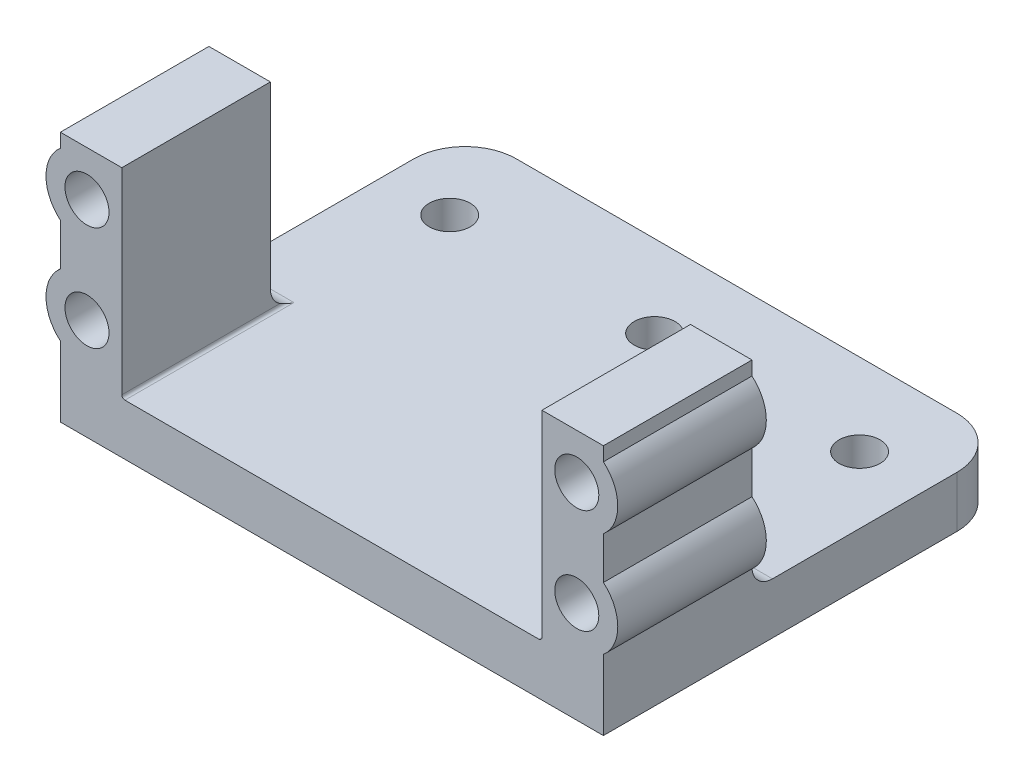
ISO-10303-21;
HEADER;
FILE_DESCRIPTION(('STEP AP214'),'2;1');
FILE_NAME('part.step','',(''),(''),'','','');
FILE_SCHEMA(('AUTOMOTIVE_DESIGN { 1 0 10303 214 1 1 1 1 }'));
ENDSEC;
DATA;
#1=APPLICATION_CONTEXT('core data for automotive mechanical design processes');
#2=APPLICATION_PROTOCOL_DEFINITION('international standard','automotive_design',2000,#1);
#3=PRODUCT_CONTEXT('',#1,'mechanical');
#4=PRODUCT('Part','Part','',(#3));
#5=PRODUCT_RELATED_PRODUCT_CATEGORY('part','',(#4));
#6=PRODUCT_DEFINITION_FORMATION('','',#4);
#7=PRODUCT_DEFINITION_CONTEXT('part definition',#1,'design');
#8=PRODUCT_DEFINITION('design','',#6,#7);
#9=PRODUCT_DEFINITION_SHAPE('','',#8);
#10=(LENGTH_UNIT() NAMED_UNIT(*) SI_UNIT(.MILLI.,.METRE.));
#11=(NAMED_UNIT(*) PLANE_ANGLE_UNIT() SI_UNIT($,.RADIAN.));
#12=(NAMED_UNIT(*) SI_UNIT($,.STERADIAN.) SOLID_ANGLE_UNIT());
#13=UNCERTAINTY_MEASURE_WITH_UNIT(LENGTH_MEASURE(1.E-05),#10,'distance_accuracy_value','');
#14=(GEOMETRIC_REPRESENTATION_CONTEXT(3) GLOBAL_UNCERTAINTY_ASSIGNED_CONTEXT((#13)) GLOBAL_UNIT_ASSIGNED_CONTEXT((#10,
#11,#12)) REPRESENTATION_CONTEXT('',''));
#15=CARTESIAN_POINT('',(0.,0.,0.));
#16=DIRECTION('',(0.,0.,1.));
#17=DIRECTION('',(1.,0.,0.));
#18=AXIS2_PLACEMENT_3D('',#15,#16,#17);
#19=CARTESIAN_POINT('',(-26.5,-2.5,26.5));
#20=DIRECTION('',(1.,0.,0.));
#21=DIRECTION('',(0.,0.,-1.));
#22=AXIS2_PLACEMENT_3D('',#19,#20,#21);
#23=PLANE('',#22);
#24=DIRECTION('',(0.,0.,1.));
#25=VECTOR('',#24,1.);
#26=CARTESIAN_POINT('',(-26.5,10.439736830714,1.10229381933987));
#27=LINE('',#26,#25);
#28=CARTESIAN_POINT('',(-26.5,10.439736830714,26.5));
#29=VERTEX_POINT('',#28);
#30=CARTESIAN_POINT('',(-26.5,10.439736830714,12.));
#31=VERTEX_POINT('',#30);
#32=EDGE_CURVE('E355',#29,#31,#27,.F.);
#33=ORIENTED_EDGE('',*,*,#32,.F.);
#34=DIRECTION('',(0.,-1.,0.));
#35=VECTOR('',#34,1.);
#36=CARTESIAN_POINT('',(-26.5,-2.5,26.5));
#37=LINE('',#36,#35);
#38=CARTESIAN_POINT('',(-26.5,14.5602631692859,26.5));
#39=VERTEX_POINT('',#38);
#40=EDGE_CURVE('E358',#39,#29,#37,.T.);
#41=ORIENTED_EDGE('',*,*,#40,.F.);
#42=DIRECTION('',(0.,0.,1.));
#43=VECTOR('',#42,1.);
#44=CARTESIAN_POINT('',(-26.5,14.5602631692859,1.10229381933987));
#45=LINE('',#44,#43);
#46=CARTESIAN_POINT('',(-26.5,14.5602631692859,12.0000000000001));
#47=VERTEX_POINT('',#46);
#48=EDGE_CURVE('E558',#47,#39,#45,.T.);
#49=ORIENTED_EDGE('',*,*,#48,.F.);
#50=DIRECTION('',(0.,1.,0.));
#51=VECTOR('',#50,1.);
#52=CARTESIAN_POINT('',(-26.5,-10.9164078649988,12.));
#53=LINE('',#52,#51);
#54=EDGE_CURVE('E359',#31,#47,#53,.T.);
#55=ORIENTED_EDGE('',*,*,#54,.F.);
#56=EDGE_LOOP('',(#33,#41,#49,#55));
#57=FACE_BOUND('',#56,.T.);
#58=ADVANCED_FACE('F32',(#57),#23,.F.);
#59=DIRECTION('',(0.,0.,-1.));
#60=VECTOR('',#59,1.);
#61=CARTESIAN_POINT('',(-26.5,-2.5,26.5));
#62=LINE('',#61,#60);
#63=CARTESIAN_POINT('',(-26.5,-2.5,26.5));
#64=VERTEX_POINT('',#63);
#65=CARTESIAN_POINT('',(-26.5,-2.5,-8.));
#66=VERTEX_POINT('',#65);
#67=EDGE_CURVE('E54',#64,#66,#62,.T.);
#68=ORIENTED_EDGE('',*,*,#67,.F.);
#69=CARTESIAN_POINT('',(-26.5,4.36026316928588,26.5));
#70=VERTEX_POINT('',#69);
#71=EDGE_CURVE('E371',#70,#64,#37,.T.);
#72=ORIENTED_EDGE('',*,*,#71,.F.);
#73=DIRECTION('',(0.,0.,1.));
#74=VECTOR('',#73,1.);
#75=CARTESIAN_POINT('',(-26.5,4.36026316928591,1.10229381933987));
#76=LINE('',#75,#74);
#77=CARTESIAN_POINT('',(-26.5,4.36026316928591,11.9951124324564));
#78=VERTEX_POINT('',#77);
#79=EDGE_CURVE('E363',#78,#70,#76,.T.);
#80=ORIENTED_EDGE('',*,*,#79,.F.);
#81=CARTESIAN_POINT('',(-26.5,4.5,10.));
#82=DIRECTION('',(1.,0.,0.));
#83=DIRECTION('',(0.,0.,-1.));
#84=AXIS2_PLACEMENT_3D('',#81,#82,#83);
#85=CIRCLE('',#84,2.);
#86=CARTESIAN_POINT('',(-26.5,2.5,10.));
#87=VERTEX_POINT('',#86);
#88=EDGE_CURVE('E435',#78,#87,#85,.T.);
#89=ORIENTED_EDGE('',*,*,#88,.T.);
#90=DIRECTION('',(0.,0.,1.));
#91=VECTOR('',#90,1.);
#92=CARTESIAN_POINT('',(-26.5,2.5,12.));
#93=LINE('',#92,#91);
#94=CARTESIAN_POINT('',(-26.5,2.5,-8.));
#95=VERTEX_POINT('',#94);
#96=EDGE_CURVE('E407',#95,#87,#93,.T.);
#97=ORIENTED_EDGE('',*,*,#96,.F.);
#98=DIRECTION('',(0.,1.,0.));
#99=VECTOR('',#98,1.);
#100=CARTESIAN_POINT('',(-26.5,-2.5,-8.));
#101=LINE('',#100,#99);
#102=EDGE_CURVE('E533',#95,#66,#101,.F.);
#103=ORIENTED_EDGE('',*,*,#102,.T.);
#104=EDGE_LOOP('',(#68,#72,#80,#89,#97,#103));
#105=FACE_BOUND('',#104,.T.);
#106=ADVANCED_FACE('F337',(#105),#23,.F.);
#107=DIRECTION('',(0.,0.,1.));
#108=VECTOR('',#107,1.);
#109=CARTESIAN_POINT('',(-26.5,20.639736830714,1.10229381933987));
#110=LINE('',#109,#108);
#111=CARTESIAN_POINT('',(-26.5,20.639736830714,26.5));
#112=VERTEX_POINT('',#111);
#113=CARTESIAN_POINT('',(-26.5,20.639736830714,12.));
#114=VERTEX_POINT('',#113);
#115=EDGE_CURVE('E476',#112,#114,#110,.F.);
#116=ORIENTED_EDGE('',*,*,#115,.F.);
#117=CARTESIAN_POINT('',(-26.5,22.,26.5));
#118=VERTEX_POINT('',#117);
#119=EDGE_CURVE('E370',#118,#112,#37,.T.);
#120=ORIENTED_EDGE('',*,*,#119,.F.);
#121=DIRECTION('',(0.,0.,-1.));
#122=VECTOR('',#121,1.);
#123=CARTESIAN_POINT('',(-26.5,22.,26.5));
#124=LINE('',#123,#122);
#125=CARTESIAN_POINT('',(-26.5,22.,12.));
#126=VERTEX_POINT('',#125);
#127=EDGE_CURVE('E224',#118,#126,#124,.T.);
#128=ORIENTED_EDGE('',*,*,#127,.T.);
#129=EDGE_CURVE('E396',#114,#126,#53,.T.);
#130=ORIENTED_EDGE('',*,*,#129,.F.);
#131=EDGE_LOOP('',(#116,#120,#128,#130));
#132=FACE_BOUND('',#131,.T.);
#133=ADVANCED_FACE('F335',(#132),#23,.F.);
#134=CARTESIAN_POINT('',(26.5,-2.5,26.5));
#135=DIRECTION('',(-1.,0.,0.));
#136=DIRECTION('',(0.,0.,1.));
#137=AXIS2_PLACEMENT_3D('',#134,#135,#136);
#138=PLANE('',#137);
#139=DIRECTION('',(0.,1.,0.));
#140=VECTOR('',#139,1.);
#141=CARTESIAN_POINT('',(26.5,-2.5,26.5));
#142=LINE('',#141,#140);
#143=CARTESIAN_POINT('',(26.5,-2.5,26.5));
#144=VERTEX_POINT('',#143);
#145=CARTESIAN_POINT('',(26.5,4.36026316928588,26.5));
#146=VERTEX_POINT('',#145);
#147=EDGE_CURVE('E378',#144,#146,#142,.T.);
#148=ORIENTED_EDGE('',*,*,#147,.F.);
#149=DIRECTION('',(0.,0.,-1.));
#150=VECTOR('',#149,1.);
#151=CARTESIAN_POINT('',(26.5,-2.5,26.5));
#152=LINE('',#151,#150);
#153=CARTESIAN_POINT('',(26.5,-2.5,-8.));
#154=VERTEX_POINT('',#153);
#155=EDGE_CURVE('E46',#144,#154,#152,.T.);
#156=ORIENTED_EDGE('',*,*,#155,.T.);
#157=DIRECTION('',(0.,-1.,0.));
#158=VECTOR('',#157,1.);
#159=CARTESIAN_POINT('',(26.5,2.5,-8.));
#160=LINE('',#159,#158);
#161=CARTESIAN_POINT('',(26.5,2.5,-8.));
#162=VERTEX_POINT('',#161);
#163=EDGE_CURVE('E11',#154,#162,#160,.F.);
#164=ORIENTED_EDGE('',*,*,#163,.T.);
#165=DIRECTION('',(0.,0.,-1.));
#166=VECTOR('',#165,1.);
#167=CARTESIAN_POINT('',(26.5,2.5,12.));
#168=LINE('',#167,#166);
#169=CARTESIAN_POINT('',(26.5,2.5,9.99999999999999));
#170=VERTEX_POINT('',#169);
#171=EDGE_CURVE('E421',#170,#162,#168,.T.);
#172=ORIENTED_EDGE('',*,*,#171,.F.);
#173=CARTESIAN_POINT('',(26.5,4.5,9.99999999999999));
#174=DIRECTION('',(-1.,0.,0.));
#175=DIRECTION('',(0.,0.,1.));
#176=AXIS2_PLACEMENT_3D('',#173,#174,#175);
#177=CIRCLE('',#176,2.);
#178=CARTESIAN_POINT('',(26.5,4.36026316928591,11.9951124324564));
#179=VERTEX_POINT('',#178);
#180=EDGE_CURVE('E291',#170,#179,#177,.T.);
#181=ORIENTED_EDGE('',*,*,#180,.T.);
#182=DIRECTION('',(0.,0.,1.));
#183=VECTOR('',#182,1.);
#184=CARTESIAN_POINT('',(26.5,4.36026316928591,1.10229381933982));
#185=LINE('',#184,#183);
#186=EDGE_CURVE('E489',#179,#146,#185,.T.);
#187=ORIENTED_EDGE('',*,*,#186,.T.);
#188=EDGE_LOOP('',(#148,#156,#164,#172,#181,#187));
#189=FACE_BOUND('',#188,.T.);
#190=ADVANCED_FACE('F329',(#189),#138,.F.);
#191=CARTESIAN_POINT('',(26.5,10.439736830714,26.5));
#192=VERTEX_POINT('',#191);
#193=CARTESIAN_POINT('',(26.5,14.5602631692859,26.5));
#194=VERTEX_POINT('',#193);
#195=EDGE_CURVE('E381',#192,#194,#142,.T.);
#196=ORIENTED_EDGE('',*,*,#195,.F.);
#197=DIRECTION('',(0.,0.,1.));
#198=VECTOR('',#197,1.);
#199=CARTESIAN_POINT('',(26.5,10.439736830714,1.10229381933982));
#200=LINE('',#199,#198);
#201=CARTESIAN_POINT('',(26.5,10.439736830714,12.));
#202=VERTEX_POINT('',#201);
#203=EDGE_CURVE('E484',#192,#202,#200,.F.);
#204=ORIENTED_EDGE('',*,*,#203,.T.);
#205=DIRECTION('',(0.,1.,0.));
#206=VECTOR('',#205,1.);
#207=CARTESIAN_POINT('',(26.5,-10.9164078649987,12.));
#208=LINE('',#207,#206);
#209=CARTESIAN_POINT('',(26.5,14.5602631692859,12.));
#210=VERTEX_POINT('',#209);
#211=EDGE_CURVE('E405',#202,#210,#208,.T.);
#212=ORIENTED_EDGE('',*,*,#211,.T.);
#213=DIRECTION('',(0.,0.,1.));
#214=VECTOR('',#213,1.);
#215=CARTESIAN_POINT('',(26.5,14.5602631692859,1.10229381933982));
#216=LINE('',#215,#214);
#217=EDGE_CURVE('E413',#210,#194,#216,.T.);
#218=ORIENTED_EDGE('',*,*,#217,.T.);
#219=EDGE_LOOP('',(#196,#204,#212,#218));
#220=FACE_BOUND('',#219,.T.);
#221=ADVANCED_FACE('F330',(#220),#138,.F.);
#222=CARTESIAN_POINT('',(-20.5,22.,26.5));
#223=DIRECTION('',(-1.,0.,0.));
#224=DIRECTION('',(0.,-1.,0.));
#225=AXIS2_PLACEMENT_3D('',#222,#223,#224);
#226=PLANE('',#225);
#227=DIRECTION('',(0.,0.,-1.));
#228=VECTOR('',#227,1.);
#229=CARTESIAN_POINT('',(-20.5,22.,26.5));
#230=LINE('',#229,#228);
#231=CARTESIAN_POINT('',(-20.5,22.,26.5));
#232=VERTEX_POINT('',#231);
#233=CARTESIAN_POINT('',(-20.5,22.,12.));
#234=VERTEX_POINT('',#233);
#235=EDGE_CURVE('E220',#232,#234,#230,.T.);
#236=ORIENTED_EDGE('',*,*,#235,.F.);
#237=DIRECTION('',(0.,1.,0.));
#238=VECTOR('',#237,1.);
#239=CARTESIAN_POINT('',(-20.5,22.,26.5));
#240=LINE('',#239,#238);
#241=CARTESIAN_POINT('',(-20.5,2.8,26.5));
#242=VERTEX_POINT('',#241);
#243=EDGE_CURVE('E417',#242,#232,#240,.T.);
#244=ORIENTED_EDGE('',*,*,#243,.F.);
#245=DIRECTION('',(0.,0.,-1.));
#246=VECTOR('',#245,1.);
#247=CARTESIAN_POINT('',(-20.5,2.8,12.));
#248=LINE('',#247,#246);
#249=CARTESIAN_POINT('',(-20.5,2.8,11.0535653752871));
#250=VERTEX_POINT('',#249);
#251=EDGE_CURVE('E213',#242,#250,#248,.T.);
#252=ORIENTED_EDGE('',*,*,#251,.T.);
#253=CARTESIAN_POINT('',(-20.5,4.5,10.));
#254=DIRECTION('',(-1.,0.,0.));
#255=DIRECTION('',(0.,-1.,0.));
#256=AXIS2_PLACEMENT_3D('',#253,#254,#255);
#257=CIRCLE('',#256,2.);
#258=CARTESIAN_POINT('',(-20.5,4.5,12.));
#259=VERTEX_POINT('',#258);
#260=EDGE_CURVE('E249',#250,#259,#257,.T.);
#261=ORIENTED_EDGE('',*,*,#260,.T.);
#262=DIRECTION('',(0.,1.,0.));
#263=VECTOR('',#262,1.);
#264=CARTESIAN_POINT('',(-20.5,-10.9164078649988,12.));
#265=LINE('',#264,#263);
#266=EDGE_CURVE('E404',#259,#234,#265,.T.);
#267=ORIENTED_EDGE('',*,*,#266,.T.);
#268=EDGE_LOOP('',(#236,#244,#252,#261,#267));
#269=FACE_BOUND('',#268,.T.);
#270=ADVANCED_FACE('F264',(#269),#226,.F.);
#271=CARTESIAN_POINT('',(-26.5,22.,26.5));
#272=DIRECTION('',(0.,-1.,0.));
#273=DIRECTION('',(1.,0.,0.));
#274=AXIS2_PLACEMENT_3D('',#271,#272,#273);
#275=PLANE('',#274);
#276=ORIENTED_EDGE('',*,*,#235,.T.);
#277=DIRECTION('',(1.,0.,0.));
#278=VECTOR('',#277,1.);
#279=CARTESIAN_POINT('',(-26.5,22.,12.));
#280=LINE('',#279,#278);
#281=EDGE_CURVE('E401',#126,#234,#280,.T.);
#282=ORIENTED_EDGE('',*,*,#281,.F.);
#283=ORIENTED_EDGE('',*,*,#127,.F.);
#284=DIRECTION('',(-1.,0.,0.));
#285=VECTOR('',#284,1.);
#286=CARTESIAN_POINT('',(-26.5,22.,26.5));
#287=LINE('',#286,#285);
#288=EDGE_CURVE('E374',#232,#118,#287,.T.);
#289=ORIENTED_EDGE('',*,*,#288,.F.);
#290=EDGE_LOOP('',(#276,#282,#283,#289));
#291=FACE_BOUND('',#290,.T.);
#292=ADVANCED_FACE('F333',(#291),#275,.F.);
#293=CARTESIAN_POINT('',(-26.5,-2.5,26.5));
#294=DIRECTION('',(0.,1.,0.));
#295=DIRECTION('',(0.,0.,1.));
#296=AXIS2_PLACEMENT_3D('',#293,#294,#295);
#297=PLANE('',#296);
#298=CARTESIAN_POINT('',(20.,-2.5,-5.));
#299=DIRECTION('',(0.,1.,0.));
#300=DIRECTION('',(0.,0.,1.));
#301=AXIS2_PLACEMENT_3D('',#298,#299,#300);
#302=CIRCLE('',#301,2.);
#303=CARTESIAN_POINT('',(20.,-2.5,-3.));
#304=VERTEX_POINT('',#303);
#305=EDGE_CURVE('E547',#304,#304,#302,.T.);
#306=ORIENTED_EDGE('',*,*,#305,.T.);
#307=EDGE_LOOP('',(#306));
#308=FACE_BOUND('',#307,.T.);
#309=CARTESIAN_POINT('',(0.,-2.5,-5.));
#310=DIRECTION('',(0.,1.,0.));
#311=DIRECTION('',(0.,0.,1.));
#312=AXIS2_PLACEMENT_3D('',#309,#310,#311);
#313=CIRCLE('',#312,2.);
#314=CARTESIAN_POINT('',(0.,-2.5,-3.));
#315=VERTEX_POINT('',#314);
#316=EDGE_CURVE('E616',#315,#315,#313,.T.);
#317=ORIENTED_EDGE('',*,*,#316,.T.);
#318=EDGE_LOOP('',(#317));
#319=FACE_BOUND('',#318,.T.);
#320=CARTESIAN_POINT('',(-20.,-2.5,-5.));
#321=DIRECTION('',(0.,1.,0.));
#322=DIRECTION('',(0.,0.,1.));
#323=AXIS2_PLACEMENT_3D('',#320,#321,#322);
#324=CIRCLE('',#323,2.);
#325=CARTESIAN_POINT('',(-20.,-2.5,-3.));
#326=VERTEX_POINT('',#325);
#327=EDGE_CURVE('E619',#326,#326,#324,.T.);
#328=ORIENTED_EDGE('',*,*,#327,.T.);
#329=EDGE_LOOP('',(#328));
#330=FACE_BOUND('',#329,.T.);
#331=ORIENTED_EDGE('',*,*,#155,.F.);
#332=DIRECTION('',(-1.,0.,0.));
#333=VECTOR('',#332,1.);
#334=CARTESIAN_POINT('',(-29.267654900714,-2.5,26.5));
#335=LINE('',#334,#333);
#336=EDGE_CURVE('E203',#144,#64,#335,.T.);
#337=ORIENTED_EDGE('',*,*,#336,.T.);
#338=ORIENTED_EDGE('',*,*,#67,.T.);
#339=CARTESIAN_POINT('',(-21.5,-2.5,-8.));
#340=DIRECTION('',(0.,1.,0.));
#341=DIRECTION('',(0.,0.,1.));
#342=AXIS2_PLACEMENT_3D('',#339,#340,#341);
#343=CIRCLE('',#342,5.);
#344=CARTESIAN_POINT('',(-21.5,-2.5,-13.));
#345=VERTEX_POINT('',#344);
#346=EDGE_CURVE('E40',#66,#345,#343,.F.);
#347=ORIENTED_EDGE('',*,*,#346,.T.);
#348=DIRECTION('',(-1.,0.,0.));
#349=VECTOR('',#348,1.);
#350=CARTESIAN_POINT('',(26.5,-2.5,-13.));
#351=LINE('',#350,#349);
#352=CARTESIAN_POINT('',(21.5,-2.5,-13.));
#353=VERTEX_POINT('',#352);
#354=EDGE_CURVE('E541',#353,#345,#351,.T.);
#355=ORIENTED_EDGE('',*,*,#354,.F.);
#356=CARTESIAN_POINT('',(21.5,-2.5,-8.));
#357=DIRECTION('',(0.,1.,0.));
#358=DIRECTION('',(0.,0.,1.));
#359=AXIS2_PLACEMENT_3D('',#356,#357,#358);
#360=CIRCLE('',#359,5.);
#361=EDGE_CURVE('E525',#353,#154,#360,.F.);
#362=ORIENTED_EDGE('',*,*,#361,.T.);
#363=EDGE_LOOP('',(#331,#337,#338,#347,#355,#362));
#364=FACE_BOUND('',#363,.T.);
#365=ADVANCED_FACE('F327',(#308,#319,#330,#364),#297,.F.);
#366=CARTESIAN_POINT('',(26.5,20.639736830714,26.5));
#367=VERTEX_POINT('',#366);
#368=CARTESIAN_POINT('',(26.5,22.,26.5));
#369=VERTEX_POINT('',#368);
#370=EDGE_CURVE('E373',#367,#369,#142,.T.);
#371=ORIENTED_EDGE('',*,*,#370,.F.);
#372=DIRECTION('',(0.,0.,1.));
#373=VECTOR('',#372,1.);
#374=CARTESIAN_POINT('',(26.5,20.639736830714,1.10229381933982));
#375=LINE('',#374,#373);
#376=CARTESIAN_POINT('',(26.5,20.639736830714,12.));
#377=VERTEX_POINT('',#376);
#378=EDGE_CURVE('E496',#367,#377,#375,.F.);
#379=ORIENTED_EDGE('',*,*,#378,.T.);
#380=CARTESIAN_POINT('',(26.5,22.,12.));
#381=VERTEX_POINT('',#380);
#382=EDGE_CURVE('E409',#377,#381,#208,.T.);
#383=ORIENTED_EDGE('',*,*,#382,.T.);
#384=DIRECTION('',(0.,0.,-1.));
#385=VECTOR('',#384,1.);
#386=CARTESIAN_POINT('',(26.5,22.,26.5));
#387=LINE('',#386,#385);
#388=EDGE_CURVE('E387',#369,#381,#387,.T.);
#389=ORIENTED_EDGE('',*,*,#388,.F.);
#390=EDGE_LOOP('',(#371,#379,#383,#389));
#391=FACE_BOUND('',#390,.T.);
#392=ADVANCED_FACE('F323',(#391),#138,.F.);
#393=CARTESIAN_POINT('',(26.5,22.,26.5));
#394=DIRECTION('',(0.,-1.,0.));
#395=DIRECTION('',(0.,0.,-1.));
#396=AXIS2_PLACEMENT_3D('',#393,#394,#395);
#397=PLANE('',#396);
#398=ORIENTED_EDGE('',*,*,#388,.T.);
#399=DIRECTION('',(1.,0.,0.));
#400=VECTOR('',#399,1.);
#401=CARTESIAN_POINT('',(26.5,22.,12.));
#402=LINE('',#401,#400);
#403=CARTESIAN_POINT('',(20.5,22.,12.));
#404=VERTEX_POINT('',#403);
#405=EDGE_CURVE('E418',#404,#381,#402,.T.);
#406=ORIENTED_EDGE('',*,*,#405,.F.);
#407=DIRECTION('',(0.,0.,-1.));
#408=VECTOR('',#407,1.);
#409=CARTESIAN_POINT('',(20.5,22.,26.5));
#410=LINE('',#409,#408);
#411=CARTESIAN_POINT('',(20.5,22.,26.5));
#412=VERTEX_POINT('',#411);
#413=EDGE_CURVE('E384',#412,#404,#410,.T.);
#414=ORIENTED_EDGE('',*,*,#413,.F.);
#415=DIRECTION('',(-1.,0.,0.));
#416=VECTOR('',#415,1.);
#417=CARTESIAN_POINT('',(26.5,22.,26.5));
#418=LINE('',#417,#416);
#419=EDGE_CURVE('E380',#369,#412,#418,.T.);
#420=ORIENTED_EDGE('',*,*,#419,.F.);
#421=EDGE_LOOP('',(#398,#406,#414,#420));
#422=FACE_BOUND('',#421,.T.);
#423=ADVANCED_FACE('F319',(#422),#397,.F.);
#424=CARTESIAN_POINT('',(20.5,22.,26.5));
#425=DIRECTION('',(1.,0.,0.));
#426=DIRECTION('',(0.,1.,0.));
#427=AXIS2_PLACEMENT_3D('',#424,#425,#426);
#428=PLANE('',#427);
#429=DIRECTION('',(0.,0.,-1.));
#430=VECTOR('',#429,1.);
#431=CARTESIAN_POINT('',(20.5,2.8,26.5));
#432=LINE('',#431,#430);
#433=CARTESIAN_POINT('',(20.5,2.8,11.0535653752871));
#434=VERTEX_POINT('',#433);
#435=CARTESIAN_POINT('',(20.5,2.8,26.5));
#436=VERTEX_POINT('',#435);
#437=EDGE_CURVE('E214',#434,#436,#432,.F.);
#438=ORIENTED_EDGE('',*,*,#437,.T.);
#439=DIRECTION('',(0.,-1.,0.));
#440=VECTOR('',#439,1.);
#441=CARTESIAN_POINT('',(20.5,22.,26.5));
#442=LINE('',#441,#440);
#443=EDGE_CURVE('E210',#412,#436,#442,.T.);
#444=ORIENTED_EDGE('',*,*,#443,.F.);
#445=ORIENTED_EDGE('',*,*,#413,.T.);
#446=DIRECTION('',(0.,1.,0.));
#447=VECTOR('',#446,1.);
#448=CARTESIAN_POINT('',(20.5,-10.9164078649987,12.));
#449=LINE('',#448,#447);
#450=CARTESIAN_POINT('',(20.5,4.5,12.));
#451=VERTEX_POINT('',#450);
#452=EDGE_CURVE('E424',#451,#404,#449,.T.);
#453=ORIENTED_EDGE('',*,*,#452,.F.);
#454=CARTESIAN_POINT('',(20.5,4.5,10.));
#455=DIRECTION('',(1.,0.,0.));
#456=DIRECTION('',(0.,1.,0.));
#457=AXIS2_PLACEMENT_3D('',#454,#455,#456);
#458=CIRCLE('',#457,2.);
#459=EDGE_CURVE('E274',#451,#434,#458,.T.);
#460=ORIENTED_EDGE('',*,*,#459,.T.);
#461=EDGE_LOOP('',(#438,#444,#445,#453,#460));
#462=FACE_BOUND('',#461,.T.);
#463=ADVANCED_FACE('F315',(#462),#428,.F.);
#464=CARTESIAN_POINT('',(-20.5,2.5,26.5));
#465=DIRECTION('',(0.,-1.,0.));
#466=DIRECTION('',(0.,0.,-1.));
#467=AXIS2_PLACEMENT_3D('',#464,#465,#466);
#468=PLANE('',#467);
#469=CARTESIAN_POINT('',(20.,2.5,-5.));
#470=DIRECTION('',(0.,1.,0.));
#471=DIRECTION('',(0.,0.,1.));
#472=AXIS2_PLACEMENT_3D('',#469,#470,#471);
#473=CIRCLE('',#472,2.);
#474=CARTESIAN_POINT('',(20.,2.5,-3.));
#475=VERTEX_POINT('',#474);
#476=EDGE_CURVE('E613',#475,#475,#473,.T.);
#477=ORIENTED_EDGE('',*,*,#476,.F.);
#478=EDGE_LOOP('',(#477));
#479=FACE_BOUND('',#478,.T.);
#480=CARTESIAN_POINT('',(0.,2.5,-5.));
#481=DIRECTION('',(0.,1.,0.));
#482=DIRECTION('',(0.,0.,1.));
#483=AXIS2_PLACEMENT_3D('',#480,#481,#482);
#484=CIRCLE('',#483,2.);
#485=CARTESIAN_POINT('',(0.,2.5,-3.));
#486=VERTEX_POINT('',#485);
#487=EDGE_CURVE('E627',#486,#486,#484,.T.);
#488=ORIENTED_EDGE('',*,*,#487,.F.);
#489=EDGE_LOOP('',(#488));
#490=FACE_BOUND('',#489,.T.);
#491=CARTESIAN_POINT('',(-20.,2.5,-5.));
#492=DIRECTION('',(0.,1.,0.));
#493=DIRECTION('',(0.,0.,1.));
#494=AXIS2_PLACEMENT_3D('',#491,#492,#493);
#495=CIRCLE('',#494,2.);
#496=CARTESIAN_POINT('',(-20.,2.5,-3.));
#497=VERTEX_POINT('',#496);
#498=EDGE_CURVE('E624',#497,#497,#495,.T.);
#499=ORIENTED_EDGE('',*,*,#498,.F.);
#500=EDGE_LOOP('',(#499));
#501=FACE_BOUND('',#500,.T.);
#502=DIRECTION('',(0.,0.,-1.));
#503=VECTOR('',#502,1.);
#504=CARTESIAN_POINT('',(-20.2,2.5,26.5));
#505=LINE('',#504,#503);
#506=CARTESIAN_POINT('',(-20.2,2.5,10.));
#507=VERTEX_POINT('',#506);
#508=CARTESIAN_POINT('',(-20.2,2.5,26.5));
#509=VERTEX_POINT('',#508);
#510=EDGE_CURVE('E200',#507,#509,#505,.F.);
#511=ORIENTED_EDGE('',*,*,#510,.T.);
#512=DIRECTION('',(-1.,0.,0.));
#513=VECTOR('',#512,1.);
#514=CARTESIAN_POINT('',(-29.267654900714,2.5,26.5));
#515=LINE('',#514,#513);
#516=CARTESIAN_POINT('',(20.2,2.5,26.5));
#517=VERTEX_POINT('',#516);
#518=EDGE_CURVE('E192',#517,#509,#515,.T.);
#519=ORIENTED_EDGE('',*,*,#518,.F.);
#520=DIRECTION('',(0.,0.,-1.));
#521=VECTOR('',#520,1.);
#522=CARTESIAN_POINT('',(20.2,2.5,12.));
#523=LINE('',#522,#521);
#524=CARTESIAN_POINT('',(20.2,2.5,10.));
#525=VERTEX_POINT('',#524);
#526=EDGE_CURVE('E197',#517,#525,#523,.T.);
#527=ORIENTED_EDGE('',*,*,#526,.T.);
#528=DIRECTION('',(1.,0.,0.));
#529=VECTOR('',#528,1.);
#530=CARTESIAN_POINT('',(26.5,2.5,9.99999999999999));
#531=LINE('',#530,#529);
#532=EDGE_CURVE('E232',#525,#170,#531,.T.);
#533=ORIENTED_EDGE('',*,*,#532,.T.);
#534=ORIENTED_EDGE('',*,*,#171,.T.);
#535=CARTESIAN_POINT('',(21.5,2.5,-8.));
#536=DIRECTION('',(0.,-1.,0.));
#537=DIRECTION('',(0.,0.,-1.));
#538=AXIS2_PLACEMENT_3D('',#535,#536,#537);
#539=CIRCLE('',#538,5.);
#540=CARTESIAN_POINT('',(21.5,2.5,-13.));
#541=VERTEX_POINT('',#540);
#542=EDGE_CURVE('E527',#162,#541,#539,.F.);
#543=ORIENTED_EDGE('',*,*,#542,.T.);
#544=DIRECTION('',(1.,0.,0.));
#545=VECTOR('',#544,1.);
#546=CARTESIAN_POINT('',(-26.5,2.5,-13.));
#547=LINE('',#546,#545);
#548=CARTESIAN_POINT('',(-21.5,2.5,-13.));
#549=VERTEX_POINT('',#548);
#550=EDGE_CURVE('E546',#549,#541,#547,.T.);
#551=ORIENTED_EDGE('',*,*,#550,.F.);
#552=CARTESIAN_POINT('',(-21.5,2.5,-8.));
#553=DIRECTION('',(0.,-1.,0.));
#554=DIRECTION('',(0.,0.,-1.));
#555=AXIS2_PLACEMENT_3D('',#552,#553,#554);
#556=CIRCLE('',#555,5.);
#557=EDGE_CURVE('E530',#549,#95,#556,.F.);
#558=ORIENTED_EDGE('',*,*,#557,.T.);
#559=ORIENTED_EDGE('',*,*,#96,.T.);
#560=DIRECTION('',(1.,0.,0.));
#561=VECTOR('',#560,1.);
#562=CARTESIAN_POINT('',(-20.2,2.5,10.));
#563=LINE('',#562,#561);
#564=EDGE_CURVE('E234',#87,#507,#563,.T.);
#565=ORIENTED_EDGE('',*,*,#564,.T.);
#566=EDGE_LOOP('',(#511,#519,#527,#533,#534,#543,#551,#558,#559,#565));
#567=FACE_BOUND('',#566,.T.);
#568=ADVANCED_FACE('F194',(#479,#490,#501,#567),#468,.F.);
#569=CARTESIAN_POINT('',(0.,0.,26.5));
#570=DIRECTION('',(0.,0.,1.));
#571=DIRECTION('',(1.,0.,0.));
#572=AXIS2_PLACEMENT_3D('',#569,#570,#571);
#573=PLANE('',#572);
#574=ORIENTED_EDGE('',*,*,#71,.T.);
#575=ORIENTED_EDGE('',*,*,#336,.F.);
#576=ORIENTED_EDGE('',*,*,#147,.T.);
#577=CARTESIAN_POINT('',(23.8999999999999,7.39999999999996,26.5));
#578=DIRECTION('',(0.,0.,1.));
#579=DIRECTION('',(1.,0.,0.));
#580=AXIS2_PLACEMENT_3D('',#577,#578,#579);
#581=CIRCLE('',#580,4.);
#582=EDGE_CURVE('E470',#146,#192,#581,.T.);
#583=ORIENTED_EDGE('',*,*,#582,.T.);
#584=ORIENTED_EDGE('',*,*,#195,.T.);
#585=CARTESIAN_POINT('',(23.8999999999999,17.6,26.5));
#586=DIRECTION('',(0.,0.,1.));
#587=DIRECTION('',(1.,0.,0.));
#588=AXIS2_PLACEMENT_3D('',#585,#586,#587);
#589=CIRCLE('',#588,4.);
#590=EDGE_CURVE('E492',#194,#367,#589,.T.);
#591=ORIENTED_EDGE('',*,*,#590,.T.);
#592=ORIENTED_EDGE('',*,*,#370,.T.);
#593=ORIENTED_EDGE('',*,*,#419,.T.);
#594=ORIENTED_EDGE('',*,*,#443,.T.);
#595=CARTESIAN_POINT('',(20.2,2.8,26.5));
#596=DIRECTION('',(0.,0.,1.));
#597=DIRECTION('',(1.,0.,0.));
#598=AXIS2_PLACEMENT_3D('',#595,#596,#597);
#599=CIRCLE('',#598,0.3);
#600=EDGE_CURVE('E206',#436,#517,#599,.F.);
#601=ORIENTED_EDGE('',*,*,#600,.T.);
#602=ORIENTED_EDGE('',*,*,#518,.T.);
#603=CARTESIAN_POINT('',(-20.2,2.8,26.5));
#604=DIRECTION('',(0.,0.,1.));
#605=DIRECTION('',(1.,0.,0.));
#606=AXIS2_PLACEMENT_3D('',#603,#604,#605);
#607=CIRCLE('',#606,0.3);
#608=EDGE_CURVE('E230',#509,#242,#607,.F.);
#609=ORIENTED_EDGE('',*,*,#608,.T.);
#610=ORIENTED_EDGE('',*,*,#243,.T.);
#611=ORIENTED_EDGE('',*,*,#288,.T.);
#612=ORIENTED_EDGE('',*,*,#119,.T.);
#613=CARTESIAN_POINT('',(-23.8999999999999,17.6,26.5));
#614=DIRECTION('',(0.,0.,-1.));
#615=DIRECTION('',(-1.,0.,0.));
#616=AXIS2_PLACEMENT_3D('',#613,#614,#615);
#617=CIRCLE('',#616,4.);
#618=EDGE_CURVE('E362',#39,#112,#617,.T.);
#619=ORIENTED_EDGE('',*,*,#618,.F.);
#620=ORIENTED_EDGE('',*,*,#40,.T.);
#621=CARTESIAN_POINT('',(-23.8999999999999,7.39999999999996,26.5));
#622=DIRECTION('',(0.,0.,-1.));
#623=DIRECTION('',(-1.,0.,0.));
#624=AXIS2_PLACEMENT_3D('',#621,#622,#623);
#625=CIRCLE('',#624,4.);
#626=EDGE_CURVE('E367',#70,#29,#625,.T.);
#627=ORIENTED_EDGE('',*,*,#626,.F.);
#628=EDGE_LOOP('',(#574,#575,#576,#583,#584,#591,#592,#593,#594,#601,#602,#609,#610,#611,#612,
#619,#620,#627));
#629=FACE_BOUND('',#628,.T.);
#630=CARTESIAN_POINT('',(-23.8999999999999,17.6,26.5));
#631=DIRECTION('',(0.,0.,-1.));
#632=DIRECTION('',(-1.,0.,0.));
#633=AXIS2_PLACEMENT_3D('',#630,#631,#632);
#634=CIRCLE('',#633,2.15);
#635=CARTESIAN_POINT('',(-26.0499999999999,17.6,26.5));
#636=VERTEX_POINT('',#635);
#637=EDGE_CURVE('E562',#636,#636,#634,.T.);
#638=ORIENTED_EDGE('',*,*,#637,.T.);
#639=EDGE_LOOP('',(#638));
#640=FACE_BOUND('',#639,.T.);
#641=CARTESIAN_POINT('',(-23.8999999999999,7.39999999999996,26.5));
#642=DIRECTION('',(0.,0.,-1.));
#643=DIRECTION('',(-1.,0.,0.));
#644=AXIS2_PLACEMENT_3D('',#641,#642,#643);
#645=CIRCLE('',#644,2.15);
#646=CARTESIAN_POINT('',(-26.0499999999999,7.39999999999996,26.5));
#647=VERTEX_POINT('',#646);
#648=EDGE_CURVE('E570',#647,#647,#645,.T.);
#649=ORIENTED_EDGE('',*,*,#648,.T.);
#650=EDGE_LOOP('',(#649));
#651=FACE_BOUND('',#650,.T.);
#652=CARTESIAN_POINT('',(23.8999999999999,7.39999999999996,26.5));
#653=DIRECTION('',(0.,0.,1.));
#654=DIRECTION('',(1.,0.,0.));
#655=AXIS2_PLACEMENT_3D('',#652,#653,#654);
#656=CIRCLE('',#655,2.15);
#657=CARTESIAN_POINT('',(26.0499999999999,7.39999999999996,26.5));
#658=VERTEX_POINT('',#657);
#659=EDGE_CURVE('E473',#658,#658,#656,.T.);
#660=ORIENTED_EDGE('',*,*,#659,.F.);
#661=EDGE_LOOP('',(#660));
#662=FACE_BOUND('',#661,.T.);
#663=CARTESIAN_POINT('',(23.8999999999999,17.6,26.5));
#664=DIRECTION('',(0.,0.,1.));
#665=DIRECTION('',(1.,0.,0.));
#666=AXIS2_PLACEMENT_3D('',#663,#664,#665);
#667=CIRCLE('',#666,2.15);
#668=CARTESIAN_POINT('',(26.0499999999999,17.6,26.5));
#669=VERTEX_POINT('',#668);
#670=EDGE_CURVE('E466',#669,#669,#667,.T.);
#671=ORIENTED_EDGE('',*,*,#670,.F.);
#672=EDGE_LOOP('',(#671));
#673=FACE_BOUND('',#672,.T.);
#674=ADVANCED_FACE('F207',(#629,#640,#651,#662,#673),#573,.T.);
#675=CARTESIAN_POINT('',(26.5,-10.9164078649987,12.));
#676=DIRECTION('',(0.,0.,1.));
#677=DIRECTION('',(1.,0.,0.));
#678=AXIS2_PLACEMENT_3D('',#675,#676,#677);
#679=PLANE('',#678);
#680=CARTESIAN_POINT('',(23.8999999999999,17.6,12.));
#681=DIRECTION('',(0.,0.,1.));
#682=DIRECTION('',(1.,0.,0.));
#683=AXIS2_PLACEMENT_3D('',#680,#681,#682);
#684=CIRCLE('',#683,2.15);
#685=CARTESIAN_POINT('',(26.0499999999999,17.6,12.));
#686=VERTEX_POINT('',#685);
#687=EDGE_CURVE('E463',#686,#686,#684,.F.);
#688=ORIENTED_EDGE('',*,*,#687,.F.);
#689=EDGE_LOOP('',(#688));
#690=FACE_BOUND('',#689,.T.);
#691=CARTESIAN_POINT('',(23.8999999999999,7.39999999999996,12.));
#692=DIRECTION('',(0.,0.,1.));
#693=DIRECTION('',(1.,0.,0.));
#694=AXIS2_PLACEMENT_3D('',#691,#692,#693);
#695=CIRCLE('',#694,2.15);
#696=CARTESIAN_POINT('',(26.0499999999999,7.39999999999996,12.));
#697=VERTEX_POINT('',#696);
#698=EDGE_CURVE('E468',#697,#697,#695,.F.);
#699=ORIENTED_EDGE('',*,*,#698,.F.);
#700=EDGE_LOOP('',(#699));
#701=FACE_BOUND('',#700,.T.);
#702=CARTESIAN_POINT('',(23.8999999999999,7.39999999999996,12.));
#703=DIRECTION('',(0.,0.,1.));
#704=DIRECTION('',(1.,0.,0.));
#705=AXIS2_PLACEMENT_3D('',#702,#703,#704);
#706=CIRCLE('',#705,4.);
#707=CARTESIAN_POINT('',(26.6549954627911,4.5,12.));
#708=VERTEX_POINT('',#707);
#709=EDGE_CURVE('E481',#202,#708,#706,.F.);
#710=ORIENTED_EDGE('',*,*,#709,.T.);
#711=DIRECTION('',(1.,0.,0.));
#712=VECTOR('',#711,1.);
#713=CARTESIAN_POINT('',(20.2,4.5,12.));
#714=LINE('',#713,#712);
#715=EDGE_CURVE('E238',#708,#451,#714,.F.);
#716=ORIENTED_EDGE('',*,*,#715,.T.);
#717=ORIENTED_EDGE('',*,*,#452,.T.);
#718=ORIENTED_EDGE('',*,*,#405,.T.);
#719=ORIENTED_EDGE('',*,*,#382,.F.);
#720=CARTESIAN_POINT('',(23.8999999999999,17.6,12.));
#721=DIRECTION('',(0.,0.,1.));
#722=DIRECTION('',(1.,0.,0.));
#723=AXIS2_PLACEMENT_3D('',#720,#721,#722);
#724=CIRCLE('',#723,4.);
#725=EDGE_CURVE('E493',#377,#210,#724,.F.);
#726=ORIENTED_EDGE('',*,*,#725,.T.);
#727=ORIENTED_EDGE('',*,*,#211,.F.);
#728=EDGE_LOOP('',(#710,#716,#717,#718,#719,#726,#727));
#729=FACE_BOUND('',#728,.T.);
#730=ADVANCED_FACE('F306',(#690,#701,#729),#679,.F.);
#731=CARTESIAN_POINT('',(-26.5,-10.9164078649988,12.));
#732=DIRECTION('',(0.,0.,1.));
#733=DIRECTION('',(1.,0.,0.));
#734=AXIS2_PLACEMENT_3D('',#731,#732,#733);
#735=PLANE('',#734);
#736=CARTESIAN_POINT('',(-23.8999999999999,17.6,12.));
#737=DIRECTION('',(0.,0.,1.));
#738=DIRECTION('',(1.,0.,0.));
#739=AXIS2_PLACEMENT_3D('',#736,#737,#738);
#740=CIRCLE('',#739,2.15);
#741=CARTESIAN_POINT('',(-21.7499999999999,17.6,12.));
#742=VERTEX_POINT('',#741);
#743=EDGE_CURVE('E560',#742,#742,#740,.T.);
#744=ORIENTED_EDGE('',*,*,#743,.T.);
#745=EDGE_LOOP('',(#744));
#746=FACE_BOUND('',#745,.T.);
#747=CARTESIAN_POINT('',(-23.8999999999999,7.39999999999996,12.));
#748=DIRECTION('',(0.,0.,1.));
#749=DIRECTION('',(1.,0.,0.));
#750=AXIS2_PLACEMENT_3D('',#747,#748,#749);
#751=CIRCLE('',#750,2.15);
#752=CARTESIAN_POINT('',(-21.7499999999999,7.39999999999996,12.));
#753=VERTEX_POINT('',#752);
#754=EDGE_CURVE('E566',#753,#753,#751,.T.);
#755=ORIENTED_EDGE('',*,*,#754,.T.);
#756=EDGE_LOOP('',(#755));
#757=FACE_BOUND('',#756,.T.);
#758=ORIENTED_EDGE('',*,*,#266,.F.);
#759=DIRECTION('',(1.,0.,0.));
#760=VECTOR('',#759,1.);
#761=CARTESIAN_POINT('',(-26.5,4.5,12.));
#762=LINE('',#761,#760);
#763=CARTESIAN_POINT('',(-26.6549954627911,4.5,12.0000000000001));
#764=VERTEX_POINT('',#763);
#765=EDGE_CURVE('E236',#259,#764,#762,.F.);
#766=ORIENTED_EDGE('',*,*,#765,.T.);
#767=CARTESIAN_POINT('',(-23.8999999999999,7.39999999999996,12.0000000000001));
#768=DIRECTION('',(0.,0.,1.));
#769=DIRECTION('',(1.,0.,0.));
#770=AXIS2_PLACEMENT_3D('',#767,#768,#769);
#771=CIRCLE('',#770,4.);
#772=EDGE_CURVE('E550',#31,#764,#771,.T.);
#773=ORIENTED_EDGE('',*,*,#772,.F.);
#774=ORIENTED_EDGE('',*,*,#54,.T.);
#775=CARTESIAN_POINT('',(-23.8999999999999,17.6,12.0000000000001));
#776=DIRECTION('',(0.,0.,1.));
#777=DIRECTION('',(1.,0.,0.));
#778=AXIS2_PLACEMENT_3D('',#775,#776,#777);
#779=CIRCLE('',#778,4.);
#780=EDGE_CURVE('E555',#114,#47,#779,.T.);
#781=ORIENTED_EDGE('',*,*,#780,.F.);
#782=ORIENTED_EDGE('',*,*,#129,.T.);
#783=ORIENTED_EDGE('',*,*,#281,.T.);
#784=EDGE_LOOP('',(#758,#766,#773,#774,#781,#782,#783));
#785=FACE_BOUND('',#784,.T.);
#786=ADVANCED_FACE('F263',(#746,#757,#785),#735,.F.);
#787=CARTESIAN_POINT('',(20.2,2.8,26.5));
#788=DIRECTION('',(0.,0.,1.));
#789=DIRECTION('',(1.,0.,0.));
#790=AXIS2_PLACEMENT_3D('',#787,#788,#789);
#791=CYLINDRICAL_SURFACE('',#790,0.3);
#792=ORIENTED_EDGE('',*,*,#600,.F.);
#793=ORIENTED_EDGE('',*,*,#437,.F.);
#794=CARTESIAN_POINT('',(20.5,2.8,11.0535653752871));
#795=CARTESIAN_POINT('',(20.4999700759873,2.78208088908715,11.0246608916762));
#796=CARTESIAN_POINT('',(20.4983981954322,2.76493340904594,10.9953369149947));
#797=CARTESIAN_POINT('',(20.4927317726651,2.73227873435301,10.9361074312203));
#798=CARTESIAN_POINT('',(20.4886430351506,2.71676786129744,10.906203415146));
#799=CARTESIAN_POINT('',(20.4785271174821,2.68748220342473,10.8461043243576));
#800=CARTESIAN_POINT('',(20.4725108444107,2.67369824313371,10.8159117932958));
#801=CARTESIAN_POINT('',(20.4589121213121,2.64775259881516,10.7551630275065));
#802=CARTESIAN_POINT('',(20.4513284645871,2.6355921766614,10.7246065297508));
#803=CARTESIAN_POINT('',(20.4299060657721,2.60595726006735,10.6444981600769));
#804=CARTESIAN_POINT('',(20.4150740462755,2.58976749132694,10.594731903277));
#805=CARTESIAN_POINT('',(20.3831781059065,2.56146171746093,10.494746597799));
#806=CARTESIAN_POINT('',(20.3661120909435,2.5493495731273,10.4445271659699));
#807=CARTESIAN_POINT('',(20.3126769668524,2.51895631948828,10.2933258022913));
#808=CARTESIAN_POINT('',(20.2740839704139,2.50663444480157,10.19184498909));
#809=CARTESIAN_POINT('',(20.2244162989764,2.50080685619297,10.0630577837893));
#810=CARTESIAN_POINT('',(20.2138264124745,2.50013147336731,10.0357010411371));
#811=CARTESIAN_POINT('',(20.2021535582249,2.50000579931947,10.0055604342522));
#812=CARTESIAN_POINT('',(20.2010767948069,2.50000000265714,10.0027802402899));
#813=CARTESIAN_POINT('',(20.2,2.5,10.));
#814=B_SPLINE_CURVE_WITH_KNOTS('',3,(#794,#795,#796,#797,#798,#799,#800,#801,#802,#803,#804,
#805,#806,#807,#808,#809,#810,#811,#812,#813),.UNSPECIFIED.,.F.,.F.,(4,2,2,2,2,2,2,2,2,4),(0.,
0.101908677016017,0.203583195270135,0.304692252328042,0.405879443179853,0.568805873084848,
0.731886134591362,1.058191586353,1.1462153543711,1.15515964318947),.UNSPECIFIED.);
#815=EDGE_CURVE('E218',#434,#525,#814,.T.);
#816=ORIENTED_EDGE('',*,*,#815,.T.);
#817=ORIENTED_EDGE('',*,*,#526,.F.);
#818=EDGE_LOOP('',(#792,#793,#816,#817));
#819=FACE_BOUND('',#818,.T.);
#820=ADVANCED_FACE('F216',(#819),#791,.F.);
#821=CARTESIAN_POINT('',(-20.2,2.8,26.5));
#822=DIRECTION('',(0.,0.,1.));
#823=DIRECTION('',(1.,0.,0.));
#824=AXIS2_PLACEMENT_3D('',#821,#822,#823);
#825=CYLINDRICAL_SURFACE('',#824,0.3);
#826=ORIENTED_EDGE('',*,*,#608,.F.);
#827=ORIENTED_EDGE('',*,*,#510,.F.);
#828=CARTESIAN_POINT('',(-20.5,2.8,11.0535653752871));
#829=CARTESIAN_POINT('',(-20.4999700759873,2.78208088908715,11.0246608916762));
#830=CARTESIAN_POINT('',(-20.4983981954322,2.76493340904594,10.9953369149947));
#831=CARTESIAN_POINT('',(-20.4927317726651,2.73227873435302,10.9361074312203));
#832=CARTESIAN_POINT('',(-20.4886430351506,2.71676786129745,10.906203415146));
#833=CARTESIAN_POINT('',(-20.4785271174821,2.68748220342474,10.8461043243576));
#834=CARTESIAN_POINT('',(-20.4725108444107,2.67369824313371,10.8159117932958));
#835=CARTESIAN_POINT('',(-20.4589121213121,2.64775259881517,10.7551630275066));
#836=CARTESIAN_POINT('',(-20.4513284645871,2.6355921766614,10.7246065297508));
#837=CARTESIAN_POINT('',(-20.4299060657721,2.60595726006735,10.6444981600769));
#838=CARTESIAN_POINT('',(-20.4150740462755,2.58976749132694,10.594731903277));
#839=CARTESIAN_POINT('',(-20.3831781059065,2.56146171746093,10.494746597799));
#840=CARTESIAN_POINT('',(-20.3661120909435,2.5493495731273,10.4445271659699));
#841=CARTESIAN_POINT('',(-20.3126769668524,2.51895631948828,10.2933258022913));
#842=CARTESIAN_POINT('',(-20.2740839704141,2.50663444480158,10.19184498909));
#843=CARTESIAN_POINT('',(-20.2244162989763,2.50080685619297,10.0630577837893));
#844=CARTESIAN_POINT('',(-20.2138264124743,2.5001314733673,10.0357010411372));
#845=CARTESIAN_POINT('',(-20.2021535582249,2.50000579931947,10.0055604342522));
#846=CARTESIAN_POINT('',(-20.2010767948069,2.50000000265714,10.0027802402899));
#847=CARTESIAN_POINT('',(-20.2,2.5,10.));
#848=B_SPLINE_CURVE_WITH_KNOTS('',3,(#828,#829,#830,#831,#832,#833,#834,#835,#836,#837,#838,
#839,#840,#841,#842,#843,#844,#845,#846,#847),.UNSPECIFIED.,.F.,.F.,(4,2,2,2,2,2,2,2,2,4),(0.,
0.101908677016006,0.203583195270114,0.304692252328031,0.405879443179852,0.568805873084848,
0.731886134591367,1.05819158635301,1.1462153543711,1.15515964318948),.UNSPECIFIED.);
#849=EDGE_CURVE('E240',#507,#250,#848,.F.);
#850=ORIENTED_EDGE('',*,*,#849,.T.);
#851=ORIENTED_EDGE('',*,*,#251,.F.);
#852=EDGE_LOOP('',(#826,#827,#850,#851));
#853=FACE_BOUND('',#852,.T.);
#854=ADVANCED_FACE('F254',(#853),#825,.F.);
#855=CARTESIAN_POINT('',(23.8999999999999,17.6,1.10229381933982));
#856=DIRECTION('',(0.,0.,1.));
#857=DIRECTION('',(1.,0.,0.));
#858=AXIS2_PLACEMENT_3D('',#855,#856,#857);
#859=CYLINDRICAL_SURFACE('',#858,4.);
#860=ORIENTED_EDGE('',*,*,#217,.F.);
#861=ORIENTED_EDGE('',*,*,#725,.F.);
#862=ORIENTED_EDGE('',*,*,#378,.F.);
#863=ORIENTED_EDGE('',*,*,#590,.F.);
#864=EDGE_LOOP('',(#860,#861,#862,#863));
#865=FACE_BOUND('',#864,.T.);
#866=ADVANCED_FACE('F258',(#865),#859,.T.);
#867=CARTESIAN_POINT('',(23.8999999999999,7.39999999999996,1.10229381933982));
#868=DIRECTION('',(0.,0.,1.));
#869=DIRECTION('',(1.,0.,0.));
#870=AXIS2_PLACEMENT_3D('',#867,#868,#869);
#871=CYLINDRICAL_SURFACE('',#870,4.);
#872=ORIENTED_EDGE('',*,*,#186,.F.);
#873=CARTESIAN_POINT('',(26.5,4.36026316928589,11.9951124324564));
#874=CARTESIAN_POINT('',(26.5264264423202,4.38286625575592,11.9967181986332));
#875=CARTESIAN_POINT('',(26.552555952056,4.40581253489304,11.9979283790169));
#876=CARTESIAN_POINT('',(26.6042211063188,4.45239147846547,11.9995575681969));
#877=CARTESIAN_POINT('',(26.6297567508467,4.47602414289972,11.9999765769944));
#878=CARTESIAN_POINT('',(26.6549954627911,4.5,12.));
#879=B_SPLINE_CURVE_WITH_KNOTS('',3,(#873,#874,#875,#876,#877,#878),.UNSPECIFIED.,.F.,.F.,(4,2,
4),(0.,0.104387393283315,0.208774786405397),.UNSPECIFIED.);
#880=EDGE_CURVE('E284',#179,#708,#879,.T.);
#881=ORIENTED_EDGE('',*,*,#880,.T.);
#882=ORIENTED_EDGE('',*,*,#709,.F.);
#883=ORIENTED_EDGE('',*,*,#203,.F.);
#884=ORIENTED_EDGE('',*,*,#582,.F.);
#885=EDGE_LOOP('',(#872,#881,#882,#883,#884));
#886=FACE_BOUND('',#885,.T.);
#887=ADVANCED_FACE('F293',(#886),#871,.T.);
#888=CARTESIAN_POINT('',(23.8999999999999,7.39999999999996,5.91888168179568));
#889=DIRECTION('',(0.,0.,1.));
#890=DIRECTION('',(1.,0.,0.));
#891=AXIS2_PLACEMENT_3D('',#888,#889,#890);
#892=CYLINDRICAL_SURFACE('',#891,2.15);
#893=ORIENTED_EDGE('',*,*,#698,.T.);
#894=EDGE_LOOP('',(#893));
#895=FACE_BOUND('',#894,.T.);
#896=ORIENTED_EDGE('',*,*,#659,.T.);
#897=EDGE_LOOP('',(#896));
#898=FACE_BOUND('',#897,.T.);
#899=ADVANCED_FACE('F298',(#895,#898),#892,.F.);
#900=CARTESIAN_POINT('',(23.8999999999999,17.6,5.91888168179568));
#901=DIRECTION('',(0.,0.,1.));
#902=DIRECTION('',(1.,0.,0.));
#903=AXIS2_PLACEMENT_3D('',#900,#901,#902);
#904=CYLINDRICAL_SURFACE('',#903,2.15);
#905=ORIENTED_EDGE('',*,*,#687,.T.);
#906=EDGE_LOOP('',(#905));
#907=FACE_BOUND('',#906,.T.);
#908=ORIENTED_EDGE('',*,*,#670,.T.);
#909=EDGE_LOOP('',(#908));
#910=FACE_BOUND('',#909,.T.);
#911=ADVANCED_FACE('F452',(#907,#910),#904,.F.);
#912=CARTESIAN_POINT('',(-23.8999999999999,17.6,1.10229381933987));
#913=DIRECTION('',(0.,0.,1.));
#914=DIRECTION('',(1.,0.,0.));
#915=AXIS2_PLACEMENT_3D('',#912,#913,#914);
#916=CYLINDRICAL_SURFACE('',#915,4.);
#917=ORIENTED_EDGE('',*,*,#618,.T.);
#918=ORIENTED_EDGE('',*,*,#115,.T.);
#919=ORIENTED_EDGE('',*,*,#780,.T.);
#920=ORIENTED_EDGE('',*,*,#48,.T.);
#921=EDGE_LOOP('',(#917,#918,#919,#920));
#922=FACE_BOUND('',#921,.T.);
#923=ADVANCED_FACE('F449',(#922),#916,.T.);
#924=CARTESIAN_POINT('',(-23.8999999999999,7.39999999999996,1.10229381933987));
#925=DIRECTION('',(0.,0.,1.));
#926=DIRECTION('',(1.,0.,0.));
#927=AXIS2_PLACEMENT_3D('',#924,#925,#926);
#928=CYLINDRICAL_SURFACE('',#927,4.);
#929=ORIENTED_EDGE('',*,*,#626,.T.);
#930=ORIENTED_EDGE('',*,*,#32,.T.);
#931=ORIENTED_EDGE('',*,*,#772,.T.);
#932=CARTESIAN_POINT('',(-26.6549954627911,4.5,12.));
#933=CARTESIAN_POINT('',(-26.6297567508467,4.47602414289972,11.9999765769944));
#934=CARTESIAN_POINT('',(-26.6042211063188,4.45239147846547,11.9995575681969));
#935=CARTESIAN_POINT('',(-26.552555952056,4.40581253489304,11.9979283790169));
#936=CARTESIAN_POINT('',(-26.5264264423202,4.38286625575592,11.9967181986332));
#937=CARTESIAN_POINT('',(-26.5,4.36026316928589,11.9951124324564));
#938=B_SPLINE_CURVE_WITH_KNOTS('',3,(#932,#933,#934,#935,#936,#937),.UNSPECIFIED.,.F.,.F.,(4,2,
4),(0.,0.104387393122082,0.208774786405397),.UNSPECIFIED.);
#939=EDGE_CURVE('E433',#764,#78,#938,.T.);
#940=ORIENTED_EDGE('',*,*,#939,.T.);
#941=ORIENTED_EDGE('',*,*,#79,.T.);
#942=EDGE_LOOP('',(#929,#930,#931,#940,#941));
#943=FACE_BOUND('',#942,.T.);
#944=ADVANCED_FACE('F443',(#943),#928,.T.);
#945=CARTESIAN_POINT('',(-23.8999999999999,7.39999999999996,5.91888168179574));
#946=DIRECTION('',(0.,0.,1.));
#947=DIRECTION('',(1.,0.,0.));
#948=AXIS2_PLACEMENT_3D('',#945,#946,#947);
#949=CYLINDRICAL_SURFACE('',#948,2.15);
#950=ORIENTED_EDGE('',*,*,#754,.F.);
#951=EDGE_LOOP('',(#950));
#952=FACE_BOUND('',#951,.T.);
#953=ORIENTED_EDGE('',*,*,#648,.F.);
#954=EDGE_LOOP('',(#953));
#955=FACE_BOUND('',#954,.T.);
#956=ADVANCED_FACE('F448',(#952,#955),#949,.F.);
#957=CARTESIAN_POINT('',(-23.8999999999999,17.6,5.91888168179574));
#958=DIRECTION('',(0.,0.,1.));
#959=DIRECTION('',(1.,0.,0.));
#960=AXIS2_PLACEMENT_3D('',#957,#958,#959);
#961=CYLINDRICAL_SURFACE('',#960,2.15);
#962=ORIENTED_EDGE('',*,*,#743,.F.);
#963=EDGE_LOOP('',(#962));
#964=FACE_BOUND('',#963,.T.);
#965=ORIENTED_EDGE('',*,*,#637,.F.);
#966=EDGE_LOOP('',(#965));
#967=FACE_BOUND('',#966,.T.);
#968=ADVANCED_FACE('F579',(#964,#967),#961,.F.);
#969=CARTESIAN_POINT('',(-20.5,4.5,10.));
#970=DIRECTION('',(-1.,0.,0.));
#971=DIRECTION('',(0.,0.,1.));
#972=AXIS2_PLACEMENT_3D('',#969,#970,#971);
#973=CYLINDRICAL_SURFACE('',#972,2.);
#974=ORIENTED_EDGE('',*,*,#939,.F.);
#975=ORIENTED_EDGE('',*,*,#765,.F.);
#976=ORIENTED_EDGE('',*,*,#260,.F.);
#977=ORIENTED_EDGE('',*,*,#849,.F.);
#978=ORIENTED_EDGE('',*,*,#564,.F.);
#979=ORIENTED_EDGE('',*,*,#88,.F.);
#980=EDGE_LOOP('',(#974,#975,#976,#977,#978,#979));
#981=FACE_BOUND('',#980,.T.);
#982=ADVANCED_FACE('F251',(#981),#973,.F.);
#983=CARTESIAN_POINT('',(-20.5,4.5,10.));
#984=DIRECTION('',(-1.,0.,0.));
#985=DIRECTION('',(0.,0.,1.));
#986=AXIS2_PLACEMENT_3D('',#983,#984,#985);
#987=CYLINDRICAL_SURFACE('',#986,2.);
#988=ORIENTED_EDGE('',*,*,#459,.F.);
#989=ORIENTED_EDGE('',*,*,#715,.F.);
#990=ORIENTED_EDGE('',*,*,#880,.F.);
#991=ORIENTED_EDGE('',*,*,#180,.F.);
#992=ORIENTED_EDGE('',*,*,#532,.F.);
#993=ORIENTED_EDGE('',*,*,#815,.F.);
#994=EDGE_LOOP('',(#988,#989,#990,#991,#992,#993));
#995=FACE_BOUND('',#994,.T.);
#996=ADVANCED_FACE('F277',(#995),#987,.F.);
#997=CARTESIAN_POINT('',(0.,0.,-13.));
#998=DIRECTION('',(0.,0.,-1.));
#999=DIRECTION('',(-1.,0.,0.));
#1000=AXIS2_PLACEMENT_3D('',#997,#998,#999);
#1001=PLANE('',#1000);
#1002=ORIENTED_EDGE('',*,*,#354,.T.);
#1003=DIRECTION('',(0.,1.,0.));
#1004=VECTOR('',#1003,1.);
#1005=CARTESIAN_POINT('',(-21.5,2.5,-13.));
#1006=LINE('',#1005,#1004);
#1007=EDGE_CURVE('E531',#345,#549,#1006,.T.);
#1008=ORIENTED_EDGE('',*,*,#1007,.T.);
#1009=ORIENTED_EDGE('',*,*,#550,.T.);
#1010=DIRECTION('',(0.,-1.,0.));
#1011=VECTOR('',#1010,1.);
#1012=CARTESIAN_POINT('',(21.5,-2.5,-13.));
#1013=LINE('',#1012,#1011);
#1014=EDGE_CURVE('E273',#541,#353,#1013,.T.);
#1015=ORIENTED_EDGE('',*,*,#1014,.T.);
#1016=EDGE_LOOP('',(#1002,#1008,#1009,#1015));
#1017=FACE_BOUND('',#1016,.T.);
#1018=ADVANCED_FACE('F280',(#1017),#1001,.T.);
#1019=CARTESIAN_POINT('',(-20.,-7.5,-5.));
#1020=DIRECTION('',(0.,1.,0.));
#1021=DIRECTION('',(0.,0.,1.));
#1022=AXIS2_PLACEMENT_3D('',#1019,#1020,#1021);
#1023=CYLINDRICAL_SURFACE('',#1022,2.);
#1024=ORIENTED_EDGE('',*,*,#498,.T.);
#1025=EDGE_LOOP('',(#1024));
#1026=FACE_BOUND('',#1025,.T.);
#1027=ORIENTED_EDGE('',*,*,#327,.F.);
#1028=EDGE_LOOP('',(#1027));
#1029=FACE_BOUND('',#1028,.T.);
#1030=ADVANCED_FACE('F596',(#1026,#1029),#1023,.F.);
#1031=CARTESIAN_POINT('',(0.,-7.5,-5.));
#1032=DIRECTION('',(0.,1.,0.));
#1033=DIRECTION('',(0.,0.,1.));
#1034=AXIS2_PLACEMENT_3D('',#1031,#1032,#1033);
#1035=CYLINDRICAL_SURFACE('',#1034,2.);
#1036=ORIENTED_EDGE('',*,*,#487,.T.);
#1037=EDGE_LOOP('',(#1036));
#1038=FACE_BOUND('',#1037,.T.);
#1039=ORIENTED_EDGE('',*,*,#316,.F.);
#1040=EDGE_LOOP('',(#1039));
#1041=FACE_BOUND('',#1040,.T.);
#1042=ADVANCED_FACE('F599',(#1038,#1041),#1035,.F.);
#1043=CARTESIAN_POINT('',(20.,-7.5,-5.));
#1044=DIRECTION('',(0.,1.,0.));
#1045=DIRECTION('',(0.,0.,1.));
#1046=AXIS2_PLACEMENT_3D('',#1043,#1044,#1045);
#1047=CYLINDRICAL_SURFACE('',#1046,2.);
#1048=ORIENTED_EDGE('',*,*,#476,.T.);
#1049=EDGE_LOOP('',(#1048));
#1050=FACE_BOUND('',#1049,.T.);
#1051=ORIENTED_EDGE('',*,*,#305,.F.);
#1052=EDGE_LOOP('',(#1051));
#1053=FACE_BOUND('',#1052,.T.);
#1054=ADVANCED_FACE('F603',(#1050,#1053),#1047,.F.);
#1055=CARTESIAN_POINT('',(-21.5,0.,-8.));
#1056=DIRECTION('',(0.,-1.,0.));
#1057=DIRECTION('',(0.,0.,-1.));
#1058=AXIS2_PLACEMENT_3D('',#1055,#1056,#1057);
#1059=CYLINDRICAL_SURFACE('',#1058,5.);
#1060=ORIENTED_EDGE('',*,*,#346,.F.);
#1061=ORIENTED_EDGE('',*,*,#102,.F.);
#1062=ORIENTED_EDGE('',*,*,#557,.F.);
#1063=ORIENTED_EDGE('',*,*,#1007,.F.);
#1064=EDGE_LOOP('',(#1060,#1061,#1062,#1063));
#1065=FACE_BOUND('',#1064,.T.);
#1066=ADVANCED_FACE('F282',(#1065),#1059,.T.);
#1067=CARTESIAN_POINT('',(21.5,0.,-8.));
#1068=DIRECTION('',(0.,1.,0.));
#1069=DIRECTION('',(0.,0.,1.));
#1070=AXIS2_PLACEMENT_3D('',#1067,#1068,#1069);
#1071=CYLINDRICAL_SURFACE('',#1070,5.);
#1072=ORIENTED_EDGE('',*,*,#542,.F.);
#1073=ORIENTED_EDGE('',*,*,#163,.F.);
#1074=ORIENTED_EDGE('',*,*,#361,.F.);
#1075=ORIENTED_EDGE('',*,*,#1014,.F.);
#1076=EDGE_LOOP('',(#1072,#1073,#1074,#1075));
#1077=FACE_BOUND('',#1076,.T.);
#1078=ADVANCED_FACE('F34',(#1077),#1071,.T.);
#1079=CLOSED_SHELL('',(#58,#106,#133,#190,#221,#270,#292,#365,#392,#423,#463,#568,#674,#730,
#786,#820,#854,#866,#887,#899,#911,#923,#944,#956,#968,#982,#996,#1018,#1030,#1042,#1054,#1066,#1078));
#1080=MANIFOLD_SOLID_BREP('B2',#1079);
#1081=ADVANCED_BREP_SHAPE_REPRESENTATION('',(#18,#1080),#14);
#1082=SHAPE_DEFINITION_REPRESENTATION(#9,#1081);
ENDSEC;
END-ISO-10303-21;
